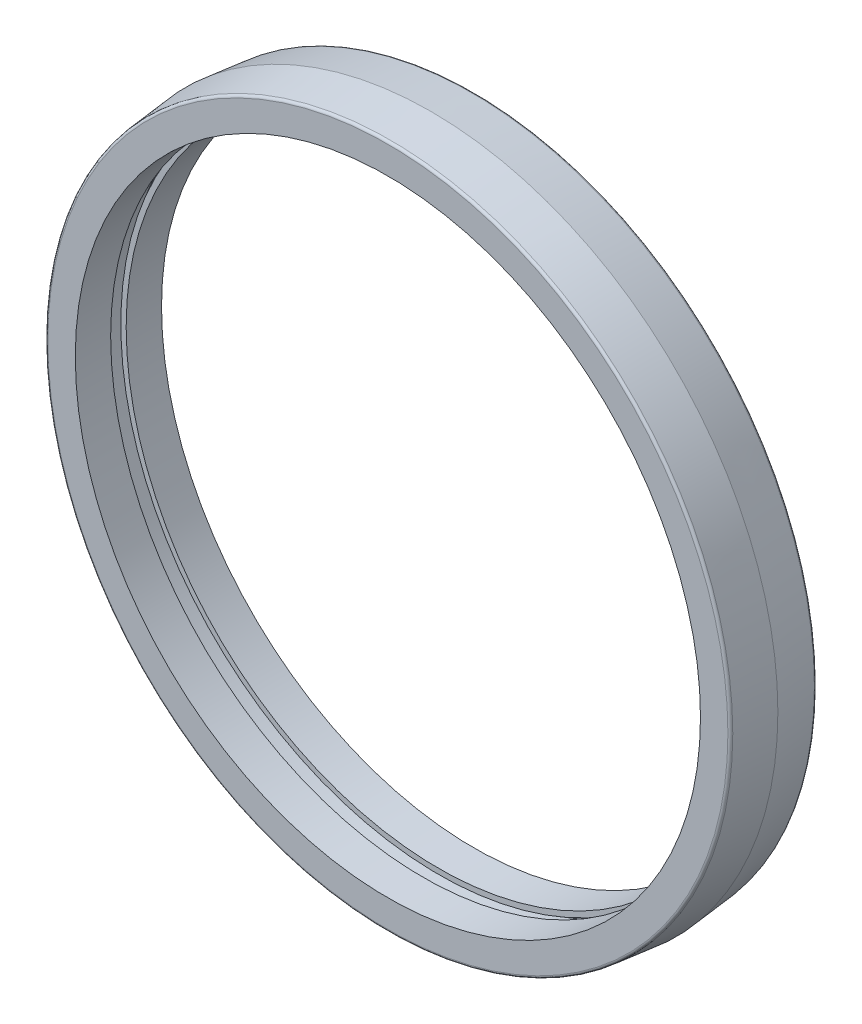
ISO-10303-21;
HEADER;
FILE_DESCRIPTION(('STEP AP214'),'2;1');
FILE_NAME('part.step','',(''),(''),'','','');
FILE_SCHEMA(('AUTOMOTIVE_DESIGN { 1 0 10303 214 1 1 1 1 }'));
ENDSEC;
DATA;
#1=APPLICATION_CONTEXT('core data for automotive mechanical design processes');
#2=APPLICATION_PROTOCOL_DEFINITION('international standard','automotive_design',2000,#1);
#3=PRODUCT_CONTEXT('',#1,'mechanical');
#4=PRODUCT('Part','Part','',(#3));
#5=PRODUCT_RELATED_PRODUCT_CATEGORY('part','',(#4));
#6=PRODUCT_DEFINITION_FORMATION('','',#4);
#7=PRODUCT_DEFINITION_CONTEXT('part definition',#1,'design');
#8=PRODUCT_DEFINITION('design','',#6,#7);
#9=PRODUCT_DEFINITION_SHAPE('','',#8);
#10=(LENGTH_UNIT() NAMED_UNIT(*) SI_UNIT(.MILLI.,.METRE.));
#11=(NAMED_UNIT(*) PLANE_ANGLE_UNIT() SI_UNIT($,.RADIAN.));
#12=(NAMED_UNIT(*) SI_UNIT($,.STERADIAN.) SOLID_ANGLE_UNIT());
#13=UNCERTAINTY_MEASURE_WITH_UNIT(LENGTH_MEASURE(1.E-05),#10,'distance_accuracy_value','');
#14=(GEOMETRIC_REPRESENTATION_CONTEXT(3) GLOBAL_UNCERTAINTY_ASSIGNED_CONTEXT((#13)) GLOBAL_UNIT_ASSIGNED_CONTEXT((#10,
#11,#12)) REPRESENTATION_CONTEXT('',''));
#15=CARTESIAN_POINT('',(0.,0.,0.));
#16=DIRECTION('',(0.,0.,1.));
#17=DIRECTION('',(1.,0.,0.));
#18=AXIS2_PLACEMENT_3D('',#15,#16,#17);
#19=CARTESIAN_POINT('',(0.,0.,54.00675));
#20=DIRECTION('',(0.,0.,1.));
#21=DIRECTION('',(1.,0.,0.));
#22=AXIS2_PLACEMENT_3D('',#19,#20,#21);
#23=CYLINDRICAL_SURFACE('',#22,95.0468);
#24=CARTESIAN_POINT('',(0.,0.,-4.7625));
#25=DIRECTION('',(0.,0.,1.));
#26=DIRECTION('',(1.,0.,0.));
#27=AXIS2_PLACEMENT_3D('',#24,#25,#26);
#28=CIRCLE('',#27,95.0468);
#29=CARTESIAN_POINT('',(95.0468,0.,-4.7625));
#30=VERTEX_POINT('',#29);
#31=EDGE_CURVE('E18',#30,#30,#28,.F.);
#32=ORIENTED_EDGE('',*,*,#31,.T.);
#33=EDGE_LOOP('',(#32));
#34=FACE_BOUND('',#33,.T.);
#35=CARTESIAN_POINT('',(0.,0.,4.7625));
#36=DIRECTION('',(0.,0.,1.));
#37=DIRECTION('',(1.,0.,0.));
#38=AXIS2_PLACEMENT_3D('',#35,#36,#37);
#39=CIRCLE('',#38,95.0468);
#40=CARTESIAN_POINT('',(95.0468,0.,4.7625));
#41=VERTEX_POINT('',#40);
#42=EDGE_CURVE('E166',#41,#41,#39,.T.);
#43=ORIENTED_EDGE('',*,*,#42,.T.);
#44=EDGE_LOOP('',(#43));
#45=FACE_BOUND('',#44,.T.);
#46=ADVANCED_FACE('F15',(#34,#45),#23,.F.);
#47=CARTESIAN_POINT('',(-95.0468,0.,-4.7625));
#48=DIRECTION('',(0.,0.,-1.));
#49=DIRECTION('',(-1.,0.,0.));
#50=AXIS2_PLACEMENT_3D('',#47,#48,#49);
#51=PLANE('',#50);
#52=CARTESIAN_POINT('',(0.,0.,-4.7625));
#53=DIRECTION('',(0.,0.,1.));
#54=DIRECTION('',(1.,0.,0.));
#55=AXIS2_PLACEMENT_3D('',#52,#53,#54);
#56=CIRCLE('',#55,93.6498);
#57=CARTESIAN_POINT('',(93.6498,0.,-4.7625));
#58=VERTEX_POINT('',#57);
#59=EDGE_CURVE('E164',#58,#58,#56,.T.);
#60=ORIENTED_EDGE('',*,*,#59,.F.);
#61=EDGE_LOOP('',(#60));
#62=FACE_BOUND('',#61,.T.);
#63=ORIENTED_EDGE('',*,*,#31,.F.);
#64=EDGE_LOOP('',(#63));
#65=FACE_BOUND('',#64,.T.);
#66=ADVANCED_FACE('F115',(#62,#65),#51,.F.);
#67=CARTESIAN_POINT('',(-93.6498,0.,4.7625));
#68=DIRECTION('',(0.,0.,1.));
#69=DIRECTION('',(1.,0.,0.));
#70=AXIS2_PLACEMENT_3D('',#67,#68,#69);
#71=PLANE('',#70);
#72=ORIENTED_EDGE('',*,*,#42,.F.);
#73=EDGE_LOOP('',(#72));
#74=FACE_BOUND('',#73,.T.);
#75=CARTESIAN_POINT('',(0.,0.,4.7625));
#76=DIRECTION('',(0.,0.,1.));
#77=DIRECTION('',(1.,0.,0.));
#78=AXIS2_PLACEMENT_3D('',#75,#76,#77);
#79=CIRCLE('',#78,93.6498);
#80=CARTESIAN_POINT('',(93.6498,0.,4.7625));
#81=VERTEX_POINT('',#80);
#82=EDGE_CURVE('E161',#81,#81,#79,.F.);
#83=ORIENTED_EDGE('',*,*,#82,.F.);
#84=EDGE_LOOP('',(#83));
#85=FACE_BOUND('',#84,.T.);
#86=ADVANCED_FACE('F112',(#74,#85),#71,.F.);
#87=CARTESIAN_POINT('',(0.,0.,54.00675));
#88=DIRECTION('',(0.,0.,1.));
#89=DIRECTION('',(1.,0.,0.));
#90=AXIS2_PLACEMENT_3D('',#87,#88,#89);
#91=CYLINDRICAL_SURFACE('',#90,93.6498);
#92=CARTESIAN_POINT('',(0.,0.,-2.286));
#93=DIRECTION('',(0.,0.,1.));
#94=DIRECTION('',(1.,0.,0.));
#95=AXIS2_PLACEMENT_3D('',#92,#93,#94);
#96=CIRCLE('',#95,93.6498);
#97=CARTESIAN_POINT('',(93.6498,0.,-2.286));
#98=VERTEX_POINT('',#97);
#99=EDGE_CURVE('E158',#98,#98,#96,.F.);
#100=ORIENTED_EDGE('',*,*,#99,.T.);
#101=EDGE_LOOP('',(#100));
#102=FACE_BOUND('',#101,.T.);
#103=ORIENTED_EDGE('',*,*,#59,.T.);
#104=EDGE_LOOP('',(#103));
#105=FACE_BOUND('',#104,.T.);
#106=ADVANCED_FACE('F108',(#102,#105),#91,.T.);
#107=CARTESIAN_POINT('',(0.,0.,54.00675));
#108=DIRECTION('',(0.,0.,1.));
#109=DIRECTION('',(1.,0.,0.));
#110=AXIS2_PLACEMENT_3D('',#107,#108,#109);
#111=CYLINDRICAL_SURFACE('',#110,93.6498);
#112=ORIENTED_EDGE('',*,*,#82,.T.);
#113=EDGE_LOOP('',(#112));
#114=FACE_BOUND('',#113,.T.);
#115=CARTESIAN_POINT('',(0.,0.,2.286));
#116=DIRECTION('',(0.,0.,1.));
#117=DIRECTION('',(1.,0.,0.));
#118=AXIS2_PLACEMENT_3D('',#115,#116,#117);
#119=CIRCLE('',#118,93.6498);
#120=CARTESIAN_POINT('',(93.6498,0.,2.286));
#121=VERTEX_POINT('',#120);
#122=EDGE_CURVE('E155',#121,#121,#119,.T.);
#123=ORIENTED_EDGE('',*,*,#122,.T.);
#124=EDGE_LOOP('',(#123));
#125=FACE_BOUND('',#124,.T.);
#126=ADVANCED_FACE('F104',(#114,#125),#111,.T.);
#127=CARTESIAN_POINT('',(-93.6498,0.,-2.286));
#128=DIRECTION('',(0.,0.,-1.));
#129=DIRECTION('',(-1.,0.,0.));
#130=AXIS2_PLACEMENT_3D('',#127,#128,#129);
#131=PLANE('',#130);
#132=CARTESIAN_POINT('',(0.,0.,-2.286));
#133=DIRECTION('',(0.,0.,1.));
#134=DIRECTION('',(1.,0.,0.));
#135=AXIS2_PLACEMENT_3D('',#132,#133,#134);
#136=CIRCLE('',#135,92.075);
#137=CARTESIAN_POINT('',(92.075,0.,-2.286));
#138=VERTEX_POINT('',#137);
#139=EDGE_CURVE('E152',#138,#138,#136,.F.);
#140=ORIENTED_EDGE('',*,*,#139,.T.);
#141=EDGE_LOOP('',(#140));
#142=FACE_BOUND('',#141,.T.);
#143=ORIENTED_EDGE('',*,*,#99,.F.);
#144=EDGE_LOOP('',(#143));
#145=FACE_BOUND('',#144,.T.);
#146=ADVANCED_FACE('F100',(#142,#145),#131,.F.);
#147=CARTESIAN_POINT('',(-92.075,0.,2.286));
#148=DIRECTION('',(0.,0.,1.));
#149=DIRECTION('',(1.,0.,0.));
#150=AXIS2_PLACEMENT_3D('',#147,#148,#149);
#151=PLANE('',#150);
#152=ORIENTED_EDGE('',*,*,#122,.F.);
#153=EDGE_LOOP('',(#152));
#154=FACE_BOUND('',#153,.T.);
#155=CARTESIAN_POINT('',(0.,0.,2.286));
#156=DIRECTION('',(0.,0.,1.));
#157=DIRECTION('',(1.,0.,0.));
#158=AXIS2_PLACEMENT_3D('',#155,#156,#157);
#159=CIRCLE('',#158,92.075);
#160=CARTESIAN_POINT('',(92.075,0.,2.286));
#161=VERTEX_POINT('',#160);
#162=EDGE_CURVE('E145',#161,#161,#159,.T.);
#163=ORIENTED_EDGE('',*,*,#162,.T.);
#164=EDGE_LOOP('',(#163));
#165=FACE_BOUND('',#164,.T.);
#166=ADVANCED_FACE('F96',(#154,#165),#151,.F.);
#167=CARTESIAN_POINT('',(0.,0.,54.00675));
#168=DIRECTION('',(0.,0.,1.));
#169=DIRECTION('',(1.,0.,0.));
#170=AXIS2_PLACEMENT_3D('',#167,#168,#169);
#171=CYLINDRICAL_SURFACE('',#170,92.075);
#172=CARTESIAN_POINT('',(0.,0.,-12.7));
#173=DIRECTION('',(0.,0.,1.));
#174=DIRECTION('',(1.,0.,0.));
#175=AXIS2_PLACEMENT_3D('',#172,#173,#174);
#176=CIRCLE('',#175,92.075);
#177=CARTESIAN_POINT('',(92.075,0.,-12.7));
#178=VERTEX_POINT('',#177);
#179=EDGE_CURVE('E140',#178,#178,#176,.F.);
#180=ORIENTED_EDGE('',*,*,#179,.T.);
#181=EDGE_LOOP('',(#180));
#182=FACE_BOUND('',#181,.T.);
#183=ORIENTED_EDGE('',*,*,#139,.F.);
#184=EDGE_LOOP('',(#183));
#185=FACE_BOUND('',#184,.T.);
#186=ADVANCED_FACE('F92',(#182,#185),#171,.F.);
#187=CARTESIAN_POINT('',(0.,0.,54.00675));
#188=DIRECTION('',(0.,0.,1.));
#189=DIRECTION('',(1.,0.,0.));
#190=AXIS2_PLACEMENT_3D('',#187,#188,#189);
#191=CYLINDRICAL_SURFACE('',#190,92.075);
#192=ORIENTED_EDGE('',*,*,#162,.F.);
#193=EDGE_LOOP('',(#192));
#194=FACE_BOUND('',#193,.T.);
#195=CARTESIAN_POINT('',(0.,0.,12.7));
#196=DIRECTION('',(0.,0.,1.));
#197=DIRECTION('',(1.,0.,0.));
#198=AXIS2_PLACEMENT_3D('',#195,#196,#197);
#199=CIRCLE('',#198,92.075);
#200=CARTESIAN_POINT('',(92.075,0.,12.7));
#201=VERTEX_POINT('',#200);
#202=EDGE_CURVE('E137',#201,#201,#199,.T.);
#203=ORIENTED_EDGE('',*,*,#202,.T.);
#204=EDGE_LOOP('',(#203));
#205=FACE_BOUND('',#204,.T.);
#206=ADVANCED_FACE('F87',(#194,#205),#191,.F.);
#207=CARTESIAN_POINT('',(-92.075,0.,-12.7));
#208=DIRECTION('',(0.,0.,1.));
#209=DIRECTION('',(1.,0.,0.));
#210=AXIS2_PLACEMENT_3D('',#207,#208,#209);
#211=PLANE('',#210);
#212=ORIENTED_EDGE('',*,*,#179,.F.);
#213=EDGE_LOOP('',(#212));
#214=FACE_BOUND('',#213,.T.);
#215=CARTESIAN_POINT('',(0.,0.,-12.7));
#216=DIRECTION('',(0.,0.,1.));
#217=DIRECTION('',(1.,0.,0.));
#218=AXIS2_PLACEMENT_3D('',#215,#216,#217);
#219=CIRCLE('',#218,100.151892118245);
#220=CARTESIAN_POINT('',(100.151892118245,0.,-12.7));
#221=VERTEX_POINT('',#220);
#222=EDGE_CURVE('E71',#221,#221,#219,.T.);
#223=ORIENTED_EDGE('',*,*,#222,.F.);
#224=EDGE_LOOP('',(#223));
#225=FACE_BOUND('',#224,.T.);
#226=ADVANCED_FACE('F77',(#214,#225),#211,.F.);
#227=CARTESIAN_POINT('',(-92.075,0.,12.7));
#228=DIRECTION('',(0.,0.,-1.));
#229=DIRECTION('',(-1.,0.,0.));
#230=AXIS2_PLACEMENT_3D('',#227,#228,#229);
#231=PLANE('',#230);
#232=ORIENTED_EDGE('',*,*,#202,.F.);
#233=EDGE_LOOP('',(#232));
#234=FACE_BOUND('',#233,.T.);
#235=CARTESIAN_POINT('',(0.,0.,12.7));
#236=DIRECTION('',(0.,0.,-1.));
#237=DIRECTION('',(-1.,0.,0.));
#238=AXIS2_PLACEMENT_3D('',#235,#236,#237);
#239=CIRCLE('',#238,100.151892118245);
#240=CARTESIAN_POINT('',(-100.151892118245,0.,12.7));
#241=VERTEX_POINT('',#240);
#242=EDGE_CURVE('E36',#241,#241,#239,.T.);
#243=ORIENTED_EDGE('',*,*,#242,.F.);
#244=EDGE_LOOP('',(#243));
#245=FACE_BOUND('',#244,.T.);
#246=ADVANCED_FACE('F86',(#234,#245),#231,.F.);
#247=CARTESIAN_POINT('',(0.,0.,-11.938));
#248=DIRECTION('',(0.,0.,1.));
#249=DIRECTION('',(1.,0.,0.));
#250=AXIS2_PLACEMENT_3D('',#247,#248,#249);
#251=TOROIDAL_SURFACE('',#250,100.151892118245,0.762);
#252=ORIENTED_EDGE('',*,*,#222,.T.);
#253=EDGE_LOOP('',(#252));
#254=FACE_BOUND('',#253,.T.);
#255=CARTESIAN_POINT('',(0.,0.,-12.0176506890098));
#256=DIRECTION('',(0.,0.,1.));
#257=DIRECTION('',(1.,0.,0.));
#258=AXIS2_PLACEMENT_3D('',#255,#256,#257);
#259=CIRCLE('',#258,100.909717802516);
#260=CARTESIAN_POINT('',(100.909717802516,0.,-12.0176506890098));
#261=VERTEX_POINT('',#260);
#262=EDGE_CURVE('E27',#261,#261,#259,.T.);
#263=ORIENTED_EDGE('',*,*,#262,.F.);
#264=EDGE_LOOP('',(#263));
#265=FACE_BOUND('',#264,.T.);
#266=ADVANCED_FACE('F50',(#254,#265),#251,.T.);
#267=CARTESIAN_POINT('',(0.,0.,11.938));
#268=DIRECTION('',(0.,0.,-1.));
#269=DIRECTION('',(-1.,0.,0.));
#270=AXIS2_PLACEMENT_3D('',#267,#268,#269);
#271=TOROIDAL_SURFACE('',#270,100.151892118245,0.762);
#272=CARTESIAN_POINT('',(0.,0.,12.0176506890098));
#273=DIRECTION('',(0.,0.,-1.));
#274=DIRECTION('',(-1.,0.,0.));
#275=AXIS2_PLACEMENT_3D('',#272,#273,#274);
#276=CIRCLE('',#275,100.909717802516);
#277=CARTESIAN_POINT('',(-100.909717802516,0.,12.0176506890098));
#278=VERTEX_POINT('',#277);
#279=EDGE_CURVE('E22',#278,#278,#276,.T.);
#280=ORIENTED_EDGE('',*,*,#279,.F.);
#281=EDGE_LOOP('',(#280));
#282=FACE_BOUND('',#281,.T.);
#283=ORIENTED_EDGE('',*,*,#242,.T.);
#284=EDGE_LOOP('',(#283));
#285=FACE_BOUND('',#284,.T.);
#286=ADVANCED_FACE('F44',(#282,#285),#271,.T.);
#287=CARTESIAN_POINT('',(0.,0.,0.));
#288=DIRECTION('',(0.,0.,1.));
#289=DIRECTION('',(1.,0.,0.));
#290=AXIS2_PLACEMENT_3D('',#287,#288,#289);
#291=CONICAL_SURFACE('',#290,102.172823787874,0.10471975511966);
#292=CARTESIAN_POINT('',(0.,0.,0.));
#293=DIRECTION('',(0.,0.,-1.));
#294=DIRECTION('',(-1.,0.,0.));
#295=AXIS2_PLACEMENT_3D('',#292,#293,#294);
#296=CIRCLE('',#295,102.172823787874);
#297=CARTESIAN_POINT('',(-102.172823787874,0.,0.));
#298=VERTEX_POINT('',#297);
#299=EDGE_CURVE('E10',#298,#298,#296,.F.);
#300=ORIENTED_EDGE('',*,*,#299,.F.);
#301=EDGE_LOOP('',(#300));
#302=FACE_BOUND('',#301,.T.);
#303=ORIENTED_EDGE('',*,*,#262,.T.);
#304=EDGE_LOOP('',(#303));
#305=FACE_BOUND('',#304,.T.);
#306=ADVANCED_FACE('F49',(#302,#305),#291,.T.);
#307=CARTESIAN_POINT('',(0.,0.,0.));
#308=DIRECTION('',(0.,0.,-1.));
#309=DIRECTION('',(-1.,0.,0.));
#310=AXIS2_PLACEMENT_3D('',#307,#308,#309);
#311=CONICAL_SURFACE('',#310,102.172823787874,0.10471975511966);
#312=ORIENTED_EDGE('',*,*,#299,.T.);
#313=EDGE_LOOP('',(#312));
#314=FACE_BOUND('',#313,.T.);
#315=ORIENTED_EDGE('',*,*,#279,.T.);
#316=EDGE_LOOP('',(#315));
#317=FACE_BOUND('',#316,.T.);
#318=ADVANCED_FACE('F126',(#314,#317),#311,.T.);
#319=CLOSED_SHELL('',(#46,#66,#86,#106,#126,#146,#166,#186,#206,#226,#246,#266,#286,#306,#318));
#320=MANIFOLD_SOLID_BREP('B1',#319);
#321=ADVANCED_BREP_SHAPE_REPRESENTATION('',(#18,#320),#14);
#322=SHAPE_DEFINITION_REPRESENTATION(#9,#321);
ENDSEC;
END-ISO-10303-21;
